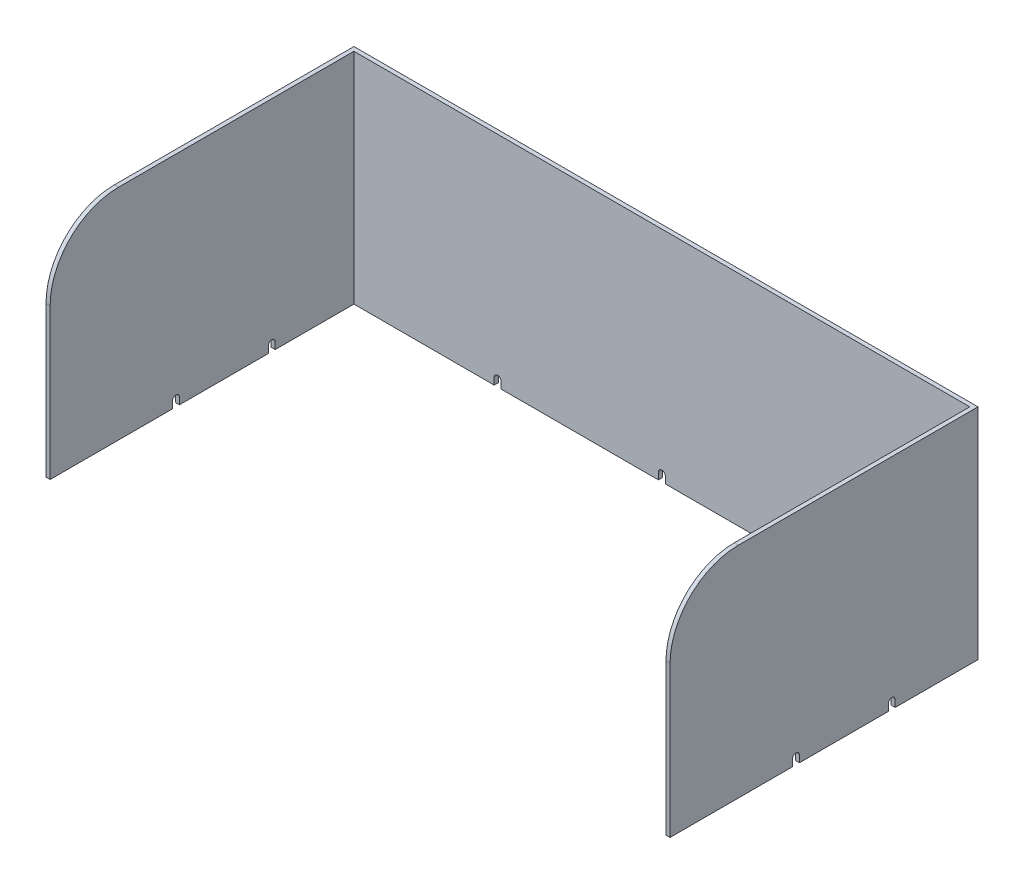
ISO-10303-21;
HEADER;
FILE_DESCRIPTION(('STEP AP214'),'2;1');
FILE_NAME('part.step','',(''),(''),'','','');
FILE_SCHEMA(('AUTOMOTIVE_DESIGN { 1 0 10303 214 1 1 1 1 }'));
ENDSEC;
DATA;
#1=APPLICATION_CONTEXT('core data for automotive mechanical design processes');
#2=APPLICATION_PROTOCOL_DEFINITION('international standard','automotive_design',2000,#1);
#3=PRODUCT_CONTEXT('',#1,'mechanical');
#4=PRODUCT('Part','Part','',(#3));
#5=PRODUCT_RELATED_PRODUCT_CATEGORY('part','',(#4));
#6=PRODUCT_DEFINITION_FORMATION('','',#4);
#7=PRODUCT_DEFINITION_CONTEXT('part definition',#1,'design');
#8=PRODUCT_DEFINITION('design','',#6,#7);
#9=PRODUCT_DEFINITION_SHAPE('','',#8);
#10=(LENGTH_UNIT() NAMED_UNIT(*) SI_UNIT(.MILLI.,.METRE.));
#11=(NAMED_UNIT(*) PLANE_ANGLE_UNIT() SI_UNIT($,.RADIAN.));
#12=(NAMED_UNIT(*) SI_UNIT($,.STERADIAN.) SOLID_ANGLE_UNIT());
#13=UNCERTAINTY_MEASURE_WITH_UNIT(LENGTH_MEASURE(1.E-05),#10,'distance_accuracy_value','');
#14=(GEOMETRIC_REPRESENTATION_CONTEXT(3) GLOBAL_UNCERTAINTY_ASSIGNED_CONTEXT((#13)) GLOBAL_UNIT_ASSIGNED_CONTEXT((#10,
#11,#12)) REPRESENTATION_CONTEXT('',''));
#15=CARTESIAN_POINT('',(0.,0.,0.));
#16=DIRECTION('',(0.,0.,1.));
#17=DIRECTION('',(1.,0.,0.));
#18=AXIS2_PLACEMENT_3D('',#15,#16,#17);
#19=CARTESIAN_POINT('',(3.00000000000002,160.,3.00000000000006));
#20=DIRECTION('',(0.,0.,-1.));
#21=DIRECTION('',(-1.,0.,0.));
#22=AXIS2_PLACEMENT_3D('',#19,#20,#21);
#23=PLANE('',#22);
#24=DIRECTION('',(0.,1.,0.));
#25=VECTOR('',#24,1.);
#26=CARTESIAN_POINT('',(345.5,0.,3.00000000000006));
#27=LINE('',#26,#25);
#28=CARTESIAN_POINT('',(345.5,0.,3.00000000000006));
#29=VERTEX_POINT('',#28);
#30=CARTESIAN_POINT('',(345.5,5.,3.00000000000006));
#31=VERTEX_POINT('',#30);
#32=EDGE_CURVE('E313',#29,#31,#27,.T.);
#33=ORIENTED_EDGE('',*,*,#32,.T.);
#34=CARTESIAN_POINT('',(348.,5.,3.00000000000006));
#35=DIRECTION('',(0.,0.,-1.));
#36=DIRECTION('',(-1.,0.,0.));
#37=AXIS2_PLACEMENT_3D('',#34,#35,#36);
#38=CIRCLE('',#37,2.50000000000002);
#39=CARTESIAN_POINT('',(350.5,5.,3.00000000000006));
#40=VERTEX_POINT('',#39);
#41=EDGE_CURVE('E292',#40,#31,#38,.F.);
#42=ORIENTED_EDGE('',*,*,#41,.F.);
#43=DIRECTION('',(0.,1.,0.));
#44=VECTOR('',#43,1.);
#45=CARTESIAN_POINT('',(350.5,0.,3.00000000000006));
#46=LINE('',#45,#44);
#47=CARTESIAN_POINT('',(350.5,0.,3.00000000000006));
#48=VERTEX_POINT('',#47);
#49=EDGE_CURVE('E303',#48,#40,#46,.T.);
#50=ORIENTED_EDGE('',*,*,#49,.F.);
#51=DIRECTION('',(1.,0.,0.));
#52=VECTOR('',#51,1.);
#53=CARTESIAN_POINT('',(3.00000000000002,0.,3.00000000000006));
#54=LINE('',#53,#52);
#55=CARTESIAN_POINT('',(453.,0.,3.00000000000006));
#56=VERTEX_POINT('',#55);
#57=EDGE_CURVE('E556',#48,#56,#54,.T.);
#58=ORIENTED_EDGE('',*,*,#57,.T.);
#59=DIRECTION('',(0.,-1.,0.));
#60=VECTOR('',#59,1.);
#61=CARTESIAN_POINT('',(453.,160.,3.00000000000006));
#62=LINE('',#61,#60);
#63=CARTESIAN_POINT('',(453.,160.,3.00000000000006));
#64=VERTEX_POINT('',#63);
#65=EDGE_CURVE('E606',#64,#56,#62,.T.);
#66=ORIENTED_EDGE('',*,*,#65,.F.);
#67=DIRECTION('',(1.,0.,0.));
#68=VECTOR('',#67,1.);
#69=CARTESIAN_POINT('',(3.00000000000002,160.,3.00000000000006));
#70=LINE('',#69,#68);
#71=CARTESIAN_POINT('',(3.00000000000002,160.,3.00000000000006));
#72=VERTEX_POINT('',#71);
#73=EDGE_CURVE('E529',#72,#64,#70,.T.);
#74=ORIENTED_EDGE('',*,*,#73,.F.);
#75=DIRECTION('',(0.,-1.,0.));
#76=VECTOR('',#75,1.);
#77=CARTESIAN_POINT('',(3.00000000000002,160.,3.00000000000006));
#78=LINE('',#77,#76);
#79=CARTESIAN_POINT('',(3.00000000000002,0.,3.00000000000006));
#80=VERTEX_POINT('',#79);
#81=EDGE_CURVE('E610',#72,#80,#78,.T.);
#82=ORIENTED_EDGE('',*,*,#81,.T.);
#83=CARTESIAN_POINT('',(105.5,0.,3.00000000000006));
#84=VERTEX_POINT('',#83);
#85=EDGE_CURVE('E558',#80,#84,#54,.T.);
#86=ORIENTED_EDGE('',*,*,#85,.T.);
#87=DIRECTION('',(0.,1.,0.));
#88=VECTOR('',#87,1.);
#89=CARTESIAN_POINT('',(105.5,0.,3.00000000000006));
#90=LINE('',#89,#88);
#91=CARTESIAN_POINT('',(105.5,5.,3.00000000000006));
#92=VERTEX_POINT('',#91);
#93=EDGE_CURVE('E375',#84,#92,#90,.T.);
#94=ORIENTED_EDGE('',*,*,#93,.T.);
#95=CARTESIAN_POINT('',(108.,5.,3.00000000000006));
#96=DIRECTION('',(0.,0.,-1.));
#97=DIRECTION('',(-1.,0.,0.));
#98=AXIS2_PLACEMENT_3D('',#95,#96,#97);
#99=CIRCLE('',#98,2.49999999999999);
#100=CARTESIAN_POINT('',(110.5,5.,3.00000000000006));
#101=VERTEX_POINT('',#100);
#102=EDGE_CURVE('E344',#101,#92,#99,.F.);
#103=ORIENTED_EDGE('',*,*,#102,.F.);
#104=DIRECTION('',(0.,1.,0.));
#105=VECTOR('',#104,1.);
#106=CARTESIAN_POINT('',(110.5,0.,3.00000000000006));
#107=LINE('',#106,#105);
#108=CARTESIAN_POINT('',(110.5,0.,3.00000000000006));
#109=VERTEX_POINT('',#108);
#110=EDGE_CURVE('E371',#109,#101,#107,.T.);
#111=ORIENTED_EDGE('',*,*,#110,.F.);
#112=CARTESIAN_POINT('',(225.5,0.,3.00000000000006));
#113=VERTEX_POINT('',#112);
#114=EDGE_CURVE('E563',#109,#113,#54,.T.);
#115=ORIENTED_EDGE('',*,*,#114,.T.);
#116=DIRECTION('',(0.,1.,0.));
#117=VECTOR('',#116,1.);
#118=CARTESIAN_POINT('',(225.5,0.,3.00000000000006));
#119=LINE('',#118,#117);
#120=CARTESIAN_POINT('',(225.5,5.,3.00000000000006));
#121=VERTEX_POINT('',#120);
#122=EDGE_CURVE('E343',#113,#121,#119,.T.);
#123=ORIENTED_EDGE('',*,*,#122,.T.);
#124=CARTESIAN_POINT('',(228.,5.,3.00000000000006));
#125=DIRECTION('',(0.,0.,-1.));
#126=DIRECTION('',(-1.,0.,0.));
#127=AXIS2_PLACEMENT_3D('',#124,#125,#126);
#128=CIRCLE('',#127,2.5);
#129=CARTESIAN_POINT('',(230.5,5.,3.00000000000006));
#130=VERTEX_POINT('',#129);
#131=EDGE_CURVE('E339',#130,#121,#128,.F.);
#132=ORIENTED_EDGE('',*,*,#131,.F.);
#133=DIRECTION('',(0.,1.,0.));
#134=VECTOR('',#133,1.);
#135=CARTESIAN_POINT('',(230.5,0.,3.00000000000006));
#136=LINE('',#135,#134);
#137=CARTESIAN_POINT('',(230.5,0.,3.00000000000006));
#138=VERTEX_POINT('',#137);
#139=EDGE_CURVE('E315',#138,#130,#136,.T.);
#140=ORIENTED_EDGE('',*,*,#139,.F.);
#141=EDGE_CURVE('E670',#138,#29,#54,.T.);
#142=ORIENTED_EDGE('',*,*,#141,.T.);
#143=EDGE_LOOP('',(#33,#42,#50,#58,#66,#74,#82,#86,#94,#103,#111,#115,#123,#132,#140,#142));
#144=FACE_BOUND('',#143,.T.);
#145=ADVANCED_FACE('F44',(#144),#23,.F.);
#146=CARTESIAN_POINT('',(456.,160.,0.));
#147=DIRECTION('',(0.,0.,1.));
#148=DIRECTION('',(1.,0.,0.));
#149=AXIS2_PLACEMENT_3D('',#146,#147,#148);
#150=PLANE('',#149);
#151=DIRECTION('',(0.,-1.,0.));
#152=VECTOR('',#151,1.);
#153=CARTESIAN_POINT('',(345.5,0.,0.));
#154=LINE('',#153,#152);
#155=CARTESIAN_POINT('',(345.5,5.,0.));
#156=VERTEX_POINT('',#155);
#157=CARTESIAN_POINT('',(345.5,0.,0.));
#158=VERTEX_POINT('',#157);
#159=EDGE_CURVE('E300',#156,#158,#154,.T.);
#160=ORIENTED_EDGE('',*,*,#159,.T.);
#161=DIRECTION('',(-1.,0.,0.));
#162=VECTOR('',#161,1.);
#163=CARTESIAN_POINT('',(456.,0.,0.));
#164=LINE('',#163,#162);
#165=CARTESIAN_POINT('',(230.5,0.,0.));
#166=VERTEX_POINT('',#165);
#167=EDGE_CURVE('E585',#158,#166,#164,.T.);
#168=ORIENTED_EDGE('',*,*,#167,.T.);
#169=DIRECTION('',(0.,-1.,0.));
#170=VECTOR('',#169,1.);
#171=CARTESIAN_POINT('',(230.5,0.,0.));
#172=LINE('',#171,#170);
#173=CARTESIAN_POINT('',(230.5,5.,0.));
#174=VERTEX_POINT('',#173);
#175=EDGE_CURVE('E352',#174,#166,#172,.T.);
#176=ORIENTED_EDGE('',*,*,#175,.F.);
#177=CARTESIAN_POINT('',(228.,5.,0.));
#178=DIRECTION('',(0.,0.,-1.));
#179=DIRECTION('',(-1.,0.,0.));
#180=AXIS2_PLACEMENT_3D('',#177,#178,#179);
#181=CIRCLE('',#180,2.5);
#182=CARTESIAN_POINT('',(225.5,5.,0.));
#183=VERTEX_POINT('',#182);
#184=EDGE_CURVE('E348',#183,#174,#181,.T.);
#185=ORIENTED_EDGE('',*,*,#184,.F.);
#186=DIRECTION('',(0.,-1.,0.));
#187=VECTOR('',#186,1.);
#188=CARTESIAN_POINT('',(225.5,0.,0.));
#189=LINE('',#188,#187);
#190=CARTESIAN_POINT('',(225.5,0.,0.));
#191=VERTEX_POINT('',#190);
#192=EDGE_CURVE('E355',#183,#191,#189,.T.);
#193=ORIENTED_EDGE('',*,*,#192,.T.);
#194=CARTESIAN_POINT('',(110.5,0.,0.));
#195=VERTEX_POINT('',#194);
#196=EDGE_CURVE('E657',#191,#195,#164,.T.);
#197=ORIENTED_EDGE('',*,*,#196,.T.);
#198=DIRECTION('',(0.,-1.,0.));
#199=VECTOR('',#198,1.);
#200=CARTESIAN_POINT('',(110.5,0.,0.));
#201=LINE('',#200,#199);
#202=CARTESIAN_POINT('',(110.5,5.,0.));
#203=VERTEX_POINT('',#202);
#204=EDGE_CURVE('E387',#203,#195,#201,.T.);
#205=ORIENTED_EDGE('',*,*,#204,.F.);
#206=CARTESIAN_POINT('',(108.,5.,0.));
#207=DIRECTION('',(0.,0.,-1.));
#208=DIRECTION('',(-1.,0.,0.));
#209=AXIS2_PLACEMENT_3D('',#206,#207,#208);
#210=CIRCLE('',#209,2.49999999999999);
#211=CARTESIAN_POINT('',(105.5,5.,0.));
#212=VERTEX_POINT('',#211);
#213=EDGE_CURVE('E383',#212,#203,#210,.T.);
#214=ORIENTED_EDGE('',*,*,#213,.F.);
#215=DIRECTION('',(0.,-1.,0.));
#216=VECTOR('',#215,1.);
#217=CARTESIAN_POINT('',(105.5,0.,0.));
#218=LINE('',#217,#216);
#219=CARTESIAN_POINT('',(105.5,0.,0.));
#220=VERTEX_POINT('',#219);
#221=EDGE_CURVE('E379',#212,#220,#218,.T.);
#222=ORIENTED_EDGE('',*,*,#221,.T.);
#223=CARTESIAN_POINT('',(0.,0.,0.));
#224=VERTEX_POINT('',#223);
#225=EDGE_CURVE('E578',#220,#224,#164,.T.);
#226=ORIENTED_EDGE('',*,*,#225,.T.);
#227=DIRECTION('',(0.,-1.,0.));
#228=VECTOR('',#227,1.);
#229=CARTESIAN_POINT('',(0.,160.,0.));
#230=LINE('',#229,#228);
#231=CARTESIAN_POINT('',(0.,160.,0.));
#232=VERTEX_POINT('',#231);
#233=EDGE_CURVE('E592',#232,#224,#230,.T.);
#234=ORIENTED_EDGE('',*,*,#233,.F.);
#235=DIRECTION('',(-1.,0.,0.));
#236=VECTOR('',#235,1.);
#237=CARTESIAN_POINT('',(456.,160.,0.));
#238=LINE('',#237,#236);
#239=CARTESIAN_POINT('',(456.,160.,0.));
#240=VERTEX_POINT('',#239);
#241=EDGE_CURVE('E540',#240,#232,#238,.T.);
#242=ORIENTED_EDGE('',*,*,#241,.F.);
#243=DIRECTION('',(0.,-1.,0.));
#244=VECTOR('',#243,1.);
#245=CARTESIAN_POINT('',(456.,160.,0.));
#246=LINE('',#245,#244);
#247=CARTESIAN_POINT('',(456.,0.,0.));
#248=VERTEX_POINT('',#247);
#249=EDGE_CURVE('E596',#240,#248,#246,.T.);
#250=ORIENTED_EDGE('',*,*,#249,.T.);
#251=CARTESIAN_POINT('',(350.5,0.,0.));
#252=VERTEX_POINT('',#251);
#253=EDGE_CURVE('E580',#248,#252,#164,.T.);
#254=ORIENTED_EDGE('',*,*,#253,.T.);
#255=DIRECTION('',(0.,-1.,0.));
#256=VECTOR('',#255,1.);
#257=CARTESIAN_POINT('',(350.5,0.,0.));
#258=LINE('',#257,#256);
#259=CARTESIAN_POINT('',(350.5,5.,0.));
#260=VERTEX_POINT('',#259);
#261=EDGE_CURVE('E326',#260,#252,#258,.T.);
#262=ORIENTED_EDGE('',*,*,#261,.F.);
#263=CARTESIAN_POINT('',(348.,5.,0.));
#264=DIRECTION('',(0.,0.,-1.));
#265=DIRECTION('',(-1.,0.,0.));
#266=AXIS2_PLACEMENT_3D('',#263,#264,#265);
#267=CIRCLE('',#266,2.50000000000002);
#268=EDGE_CURVE('E295',#156,#260,#267,.T.);
#269=ORIENTED_EDGE('',*,*,#268,.F.);
#270=EDGE_LOOP('',(#160,#168,#176,#185,#193,#197,#205,#214,#222,#226,#234,#242,#250,#254,#262,#269));
#271=FACE_BOUND('',#270,.T.);
#272=ADVANCED_FACE('F773',(#271),#150,.F.);
#273=CARTESIAN_POINT('',(0.,0.,0.));
#274=DIRECTION('',(0.,1.,0.));
#275=DIRECTION('',(0.,0.,1.));
#276=AXIS2_PLACEMENT_3D('',#273,#274,#275);
#277=PLANE('',#276);
#278=DIRECTION('',(0.,0.,-1.));
#279=VECTOR('',#278,1.);
#280=CARTESIAN_POINT('',(345.5,0.,225.001));
#281=LINE('',#280,#279);
#282=EDGE_CURVE('E334',#29,#158,#281,.T.);
#283=ORIENTED_EDGE('',*,*,#282,.F.);
#284=ORIENTED_EDGE('',*,*,#141,.F.);
#285=DIRECTION('',(0.,0.,-1.));
#286=VECTOR('',#285,1.);
#287=CARTESIAN_POINT('',(230.5,0.,225.001));
#288=LINE('',#287,#286);
#289=EDGE_CURVE('E365',#138,#166,#288,.T.);
#290=ORIENTED_EDGE('',*,*,#289,.T.);
#291=ORIENTED_EDGE('',*,*,#167,.F.);
#292=EDGE_LOOP('',(#283,#284,#290,#291));
#293=FACE_BOUND('',#292,.T.);
#294=ADVANCED_FACE('F807',(#293),#277,.F.);
#295=DIRECTION('',(0.,0.,-1.));
#296=VECTOR('',#295,1.);
#297=CARTESIAN_POINT('',(225.5,0.,225.001));
#298=LINE('',#297,#296);
#299=EDGE_CURVE('E362',#113,#191,#298,.T.);
#300=ORIENTED_EDGE('',*,*,#299,.F.);
#301=ORIENTED_EDGE('',*,*,#114,.F.);
#302=DIRECTION('',(0.,0.,-1.));
#303=VECTOR('',#302,1.);
#304=CARTESIAN_POINT('',(110.5,0.,225.001));
#305=LINE('',#304,#303);
#306=EDGE_CURVE('E394',#109,#195,#305,.T.);
#307=ORIENTED_EDGE('',*,*,#306,.T.);
#308=ORIENTED_EDGE('',*,*,#196,.F.);
#309=EDGE_LOOP('',(#300,#301,#307,#308));
#310=FACE_BOUND('',#309,.T.);
#311=ADVANCED_FACE('F866',(#310),#277,.F.);
#312=DIRECTION('',(0.,0.,-1.));
#313=VECTOR('',#312,1.);
#314=CARTESIAN_POINT('',(105.5,0.,225.001));
#315=LINE('',#314,#313);
#316=EDGE_CURVE('E391',#84,#220,#315,.T.);
#317=ORIENTED_EDGE('',*,*,#316,.F.);
#318=ORIENTED_EDGE('',*,*,#85,.F.);
#319=DIRECTION('',(0.,0.,-1.));
#320=VECTOR('',#319,1.);
#321=CARTESIAN_POINT('',(3.00000000000008,0.,225.));
#322=LINE('',#321,#320);
#323=CARTESIAN_POINT('',(3.00000000000006,0.,60.5));
#324=VERTEX_POINT('',#323);
#325=EDGE_CURVE('E551',#324,#80,#322,.T.);
#326=ORIENTED_EDGE('',*,*,#325,.F.);
#327=DIRECTION('',(-1.,0.,0.));
#328=VECTOR('',#327,1.);
#329=CARTESIAN_POINT('',(0.,0.,60.5));
#330=LINE('',#329,#328);
#331=CARTESIAN_POINT('',(0.,0.,60.5));
#332=VERTEX_POINT('',#331);
#333=EDGE_CURVE('E624',#324,#332,#330,.T.);
#334=ORIENTED_EDGE('',*,*,#333,.T.);
#335=DIRECTION('',(0.,0.,1.));
#336=VECTOR('',#335,1.);
#337=CARTESIAN_POINT('',(0.,0.,0.));
#338=LINE('',#337,#336);
#339=EDGE_CURVE('E530',#224,#332,#338,.T.);
#340=ORIENTED_EDGE('',*,*,#339,.F.);
#341=ORIENTED_EDGE('',*,*,#225,.F.);
#342=EDGE_LOOP('',(#317,#318,#326,#334,#340,#341));
#343=FACE_BOUND('',#342,.T.);
#344=ADVANCED_FACE('F780',(#343),#277,.F.);
#345=CARTESIAN_POINT('',(3.00000000000008,160.,225.));
#346=DIRECTION('',(-1.,0.,0.));
#347=DIRECTION('',(0.,0.,1.));
#348=AXIS2_PLACEMENT_3D('',#345,#346,#347);
#349=PLANE('',#348);
#350=DIRECTION('',(0.,0.,-1.));
#351=VECTOR('',#350,1.);
#352=CARTESIAN_POINT('',(3.00000000000008,160.,225.));
#353=LINE('',#352,#351);
#354=CARTESIAN_POINT('',(3.00000000000007,160.,175.));
#355=VERTEX_POINT('',#354);
#356=EDGE_CURVE('E526',#355,#72,#353,.T.);
#357=ORIENTED_EDGE('',*,*,#356,.F.);
#358=CARTESIAN_POINT('',(3.00000000000007,110.,175.));
#359=DIRECTION('',(-1.,0.,0.));
#360=DIRECTION('',(0.,0.,1.));
#361=AXIS2_PLACEMENT_3D('',#358,#359,#360);
#362=CIRCLE('',#361,50.);
#363=CARTESIAN_POINT('',(3.00000000000008,110.,225.));
#364=VERTEX_POINT('',#363);
#365=EDGE_CURVE('E67',#355,#364,#362,.F.);
#366=ORIENTED_EDGE('',*,*,#365,.T.);
#367=DIRECTION('',(0.,-1.,0.));
#368=VECTOR('',#367,1.);
#369=CARTESIAN_POINT('',(3.00000000000008,160.,225.));
#370=LINE('',#369,#368);
#371=CARTESIAN_POINT('',(3.00000000000008,0.,225.));
#372=VERTEX_POINT('',#371);
#373=EDGE_CURVE('E614',#364,#372,#370,.T.);
#374=ORIENTED_EDGE('',*,*,#373,.T.);
#375=CARTESIAN_POINT('',(3.00000000000006,0.,135.5));
#376=VERTEX_POINT('',#375);
#377=EDGE_CURVE('E552',#372,#376,#322,.T.);
#378=ORIENTED_EDGE('',*,*,#377,.T.);
#379=DIRECTION('',(0.,-1.,0.));
#380=VECTOR('',#379,1.);
#381=CARTESIAN_POINT('',(3.00000000000006,160.,135.5));
#382=LINE('',#381,#380);
#383=CARTESIAN_POINT('',(3.00000000000006,5.00000000000001,135.5));
#384=VERTEX_POINT('',#383);
#385=EDGE_CURVE('E492',#384,#376,#382,.T.);
#386=ORIENTED_EDGE('',*,*,#385,.F.);
#387=CARTESIAN_POINT('',(3.00000000000006,5.,133.));
#388=DIRECTION('',(-1.,0.,0.));
#389=DIRECTION('',(0.,0.,1.));
#390=AXIS2_PLACEMENT_3D('',#387,#388,#389);
#391=CIRCLE('',#390,2.5);
#392=CARTESIAN_POINT('',(3.00000000000006,5.00000000000001,130.5));
#393=VERTEX_POINT('',#392);
#394=EDGE_CURVE('E513',#384,#393,#391,.T.);
#395=ORIENTED_EDGE('',*,*,#394,.T.);
#396=DIRECTION('',(0.,-1.,0.));
#397=VECTOR('',#396,1.);
#398=CARTESIAN_POINT('',(3.00000000000006,160.,130.5));
#399=LINE('',#398,#397);
#400=CARTESIAN_POINT('',(3.00000000000006,0.,130.5));
#401=VERTEX_POINT('',#400);
#402=EDGE_CURVE('E485',#393,#401,#399,.T.);
#403=ORIENTED_EDGE('',*,*,#402,.T.);
#404=CARTESIAN_POINT('',(3.00000000000006,0.,65.5));
#405=VERTEX_POINT('',#404);
#406=EDGE_CURVE('E557',#401,#405,#322,.T.);
#407=ORIENTED_EDGE('',*,*,#406,.T.);
#408=DIRECTION('',(0.,-1.,0.));
#409=VECTOR('',#408,1.);
#410=CARTESIAN_POINT('',(3.00000000000004,160.,65.5));
#411=LINE('',#410,#409);
#412=CARTESIAN_POINT('',(3.,5.,65.5));
#413=VERTEX_POINT('',#412);
#414=EDGE_CURVE('E506',#413,#405,#411,.T.);
#415=ORIENTED_EDGE('',*,*,#414,.F.);
#416=CARTESIAN_POINT('',(3.,5.,63.));
#417=DIRECTION('',(-1.,0.,0.));
#418=DIRECTION('',(0.,0.,1.));
#419=AXIS2_PLACEMENT_3D('',#416,#417,#418);
#420=CIRCLE('',#419,2.5);
#421=CARTESIAN_POINT('',(3.,5.,60.5));
#422=VERTEX_POINT('',#421);
#423=EDGE_CURVE('E521',#413,#422,#420,.T.);
#424=ORIENTED_EDGE('',*,*,#423,.T.);
#425=DIRECTION('',(0.,-1.,0.));
#426=VECTOR('',#425,1.);
#427=CARTESIAN_POINT('',(3.00000000000004,160.,60.5));
#428=LINE('',#427,#426);
#429=EDGE_CURVE('E499',#422,#324,#428,.T.);
#430=ORIENTED_EDGE('',*,*,#429,.T.);
#431=ORIENTED_EDGE('',*,*,#325,.T.);
#432=ORIENTED_EDGE('',*,*,#81,.F.);
#433=EDGE_LOOP('',(#357,#366,#374,#378,#386,#395,#403,#407,#415,#424,#430,#431,#432));
#434=FACE_BOUND('',#433,.T.);
#435=ADVANCED_FACE('F701',(#434),#349,.F.);
#436=CARTESIAN_POINT('',(453.,160.,3.00000000000006));
#437=DIRECTION('',(1.,0.,0.));
#438=DIRECTION('',(0.,0.,-1.));
#439=AXIS2_PLACEMENT_3D('',#436,#437,#438);
#440=PLANE('',#439);
#441=DIRECTION('',(0.,-1.,0.));
#442=VECTOR('',#441,1.);
#443=CARTESIAN_POINT('',(453.,160.,225.));
#444=LINE('',#443,#442);
#445=CARTESIAN_POINT('',(453.,110.,225.));
#446=VERTEX_POINT('',#445);
#447=CARTESIAN_POINT('',(453.,0.,225.));
#448=VERTEX_POINT('',#447);
#449=EDGE_CURVE('E603',#446,#448,#444,.T.);
#450=ORIENTED_EDGE('',*,*,#449,.F.);
#451=CARTESIAN_POINT('',(453.,110.,175.));
#452=DIRECTION('',(1.,0.,0.));
#453=DIRECTION('',(0.,0.,-1.));
#454=AXIS2_PLACEMENT_3D('',#451,#452,#453);
#455=CIRCLE('',#454,50.);
#456=CARTESIAN_POINT('',(453.,160.,175.));
#457=VERTEX_POINT('',#456);
#458=EDGE_CURVE('E645',#446,#457,#455,.F.);
#459=ORIENTED_EDGE('',*,*,#458,.T.);
#460=DIRECTION('',(0.,0.,1.));
#461=VECTOR('',#460,1.);
#462=CARTESIAN_POINT('',(453.,160.,3.00000000000006));
#463=LINE('',#462,#461);
#464=EDGE_CURVE('E533',#64,#457,#463,.T.);
#465=ORIENTED_EDGE('',*,*,#464,.F.);
#466=ORIENTED_EDGE('',*,*,#65,.T.);
#467=DIRECTION('',(0.,0.,1.));
#468=VECTOR('',#467,1.);
#469=CARTESIAN_POINT('',(453.,0.,3.00000000000006));
#470=LINE('',#469,#468);
#471=CARTESIAN_POINT('',(453.,0.,60.5));
#472=VERTEX_POINT('',#471);
#473=EDGE_CURVE('E564',#56,#472,#470,.T.);
#474=ORIENTED_EDGE('',*,*,#473,.T.);
#475=DIRECTION('',(0.,1.,0.));
#476=VECTOR('',#475,1.);
#477=CARTESIAN_POINT('',(453.,160.,60.4999999999999));
#478=LINE('',#477,#476);
#479=CARTESIAN_POINT('',(453.,5.,60.4999999999999));
#480=VERTEX_POINT('',#479);
#481=EDGE_CURVE('E495',#472,#480,#478,.T.);
#482=ORIENTED_EDGE('',*,*,#481,.T.);
#483=CARTESIAN_POINT('',(453.,5.,62.9999999999999));
#484=DIRECTION('',(1.,0.,0.));
#485=DIRECTION('',(0.,0.,-1.));
#486=AXIS2_PLACEMENT_3D('',#483,#484,#485);
#487=CIRCLE('',#486,2.5);
#488=CARTESIAN_POINT('',(453.,5.,65.4999999999999));
#489=VERTEX_POINT('',#488);
#490=EDGE_CURVE('E517',#480,#489,#487,.T.);
#491=ORIENTED_EDGE('',*,*,#490,.T.);
#492=DIRECTION('',(0.,1.,0.));
#493=VECTOR('',#492,1.);
#494=CARTESIAN_POINT('',(453.,160.,65.4999999999999));
#495=LINE('',#494,#493);
#496=CARTESIAN_POINT('',(453.,0.,65.4999999999999));
#497=VERTEX_POINT('',#496);
#498=EDGE_CURVE('E503',#497,#489,#495,.T.);
#499=ORIENTED_EDGE('',*,*,#498,.F.);
#500=CARTESIAN_POINT('',(453.,0.,130.5));
#501=VERTEX_POINT('',#500);
#502=EDGE_CURVE('E569',#497,#501,#470,.T.);
#503=ORIENTED_EDGE('',*,*,#502,.T.);
#504=DIRECTION('',(0.,1.,0.));
#505=VECTOR('',#504,1.);
#506=CARTESIAN_POINT('',(453.,160.,130.5));
#507=LINE('',#506,#505);
#508=CARTESIAN_POINT('',(453.,5.00000000000001,130.5));
#509=VERTEX_POINT('',#508);
#510=EDGE_CURVE('E445',#501,#509,#507,.T.);
#511=ORIENTED_EDGE('',*,*,#510,.T.);
#512=CARTESIAN_POINT('',(453.,5.,133.));
#513=DIRECTION('',(1.,0.,0.));
#514=DIRECTION('',(0.,0.,-1.));
#515=AXIS2_PLACEMENT_3D('',#512,#513,#514);
#516=CIRCLE('',#515,2.5);
#517=CARTESIAN_POINT('',(453.,5.00000000000001,135.5));
#518=VERTEX_POINT('',#517);
#519=EDGE_CURVE('E509',#509,#518,#516,.T.);
#520=ORIENTED_EDGE('',*,*,#519,.T.);
#521=DIRECTION('',(0.,1.,0.));
#522=VECTOR('',#521,1.);
#523=CARTESIAN_POINT('',(453.,160.,135.5));
#524=LINE('',#523,#522);
#525=CARTESIAN_POINT('',(453.,0.,135.5));
#526=VERTEX_POINT('',#525);
#527=EDGE_CURVE('E489',#526,#518,#524,.T.);
#528=ORIENTED_EDGE('',*,*,#527,.F.);
#529=EDGE_CURVE('E562',#526,#448,#470,.T.);
#530=ORIENTED_EDGE('',*,*,#529,.T.);
#531=EDGE_LOOP('',(#450,#459,#465,#466,#474,#482,#491,#499,#503,#511,#520,#528,#530));
#532=FACE_BOUND('',#531,.T.);
#533=ADVANCED_FACE('F747',(#532),#440,.F.);
#534=CARTESIAN_POINT('',(456.,160.,225.));
#535=DIRECTION('',(-1.,0.,0.));
#536=DIRECTION('',(0.,0.,1.));
#537=AXIS2_PLACEMENT_3D('',#534,#535,#536);
#538=PLANE('',#537);
#539=DIRECTION('',(0.,0.,-1.));
#540=VECTOR('',#539,1.);
#541=CARTESIAN_POINT('',(456.,160.,225.));
#542=LINE('',#541,#540);
#543=CARTESIAN_POINT('',(456.,160.,175.));
#544=VERTEX_POINT('',#543);
#545=EDGE_CURVE('E537',#544,#240,#542,.T.);
#546=ORIENTED_EDGE('',*,*,#545,.F.);
#547=CARTESIAN_POINT('',(456.,110.,175.));
#548=DIRECTION('',(-1.,0.,0.));
#549=DIRECTION('',(0.,0.,1.));
#550=AXIS2_PLACEMENT_3D('',#547,#548,#549);
#551=CIRCLE('',#550,50.);
#552=CARTESIAN_POINT('',(456.,110.,225.));
#553=VERTEX_POINT('',#552);
#554=EDGE_CURVE('E639',#544,#553,#551,.F.);
#555=ORIENTED_EDGE('',*,*,#554,.T.);
#556=DIRECTION('',(0.,-1.,0.));
#557=VECTOR('',#556,1.);
#558=CARTESIAN_POINT('',(456.,160.,225.));
#559=LINE('',#558,#557);
#560=CARTESIAN_POINT('',(456.,0.,225.));
#561=VERTEX_POINT('',#560);
#562=EDGE_CURVE('E600',#553,#561,#559,.T.);
#563=ORIENTED_EDGE('',*,*,#562,.T.);
#564=DIRECTION('',(0.,0.,-1.));
#565=VECTOR('',#564,1.);
#566=CARTESIAN_POINT('',(456.,0.,225.));
#567=LINE('',#566,#565);
#568=CARTESIAN_POINT('',(456.,0.,135.5));
#569=VERTEX_POINT('',#568);
#570=EDGE_CURVE('E574',#561,#569,#567,.T.);
#571=ORIENTED_EDGE('',*,*,#570,.T.);
#572=DIRECTION('',(0.,1.,0.));
#573=VECTOR('',#572,1.);
#574=CARTESIAN_POINT('',(456.,0.,135.5));
#575=LINE('',#574,#573);
#576=CARTESIAN_POINT('',(456.,5.,135.5));
#577=VERTEX_POINT('',#576);
#578=EDGE_CURVE('E449',#569,#577,#575,.T.);
#579=ORIENTED_EDGE('',*,*,#578,.T.);
#580=CARTESIAN_POINT('',(456.,5.,133.));
#581=DIRECTION('',(-1.,0.,0.));
#582=DIRECTION('',(0.,0.,1.));
#583=AXIS2_PLACEMENT_3D('',#580,#581,#582);
#584=CIRCLE('',#583,2.5);
#585=CARTESIAN_POINT('',(456.,5.00000000000001,130.5));
#586=VERTEX_POINT('',#585);
#587=EDGE_CURVE('E420',#586,#577,#584,.F.);
#588=ORIENTED_EDGE('',*,*,#587,.F.);
#589=DIRECTION('',(0.,1.,0.));
#590=VECTOR('',#589,1.);
#591=CARTESIAN_POINT('',(456.,0.,130.5));
#592=LINE('',#591,#590);
#593=CARTESIAN_POINT('',(456.,0.,130.5));
#594=VERTEX_POINT('',#593);
#595=EDGE_CURVE('E446',#594,#586,#592,.T.);
#596=ORIENTED_EDGE('',*,*,#595,.F.);
#597=CARTESIAN_POINT('',(456.,0.,65.5));
#598=VERTEX_POINT('',#597);
#599=EDGE_CURVE('E579',#594,#598,#567,.T.);
#600=ORIENTED_EDGE('',*,*,#599,.T.);
#601=DIRECTION('',(0.,1.,0.));
#602=VECTOR('',#601,1.);
#603=CARTESIAN_POINT('',(456.,0.,65.4999999999999));
#604=LINE('',#603,#602);
#605=CARTESIAN_POINT('',(456.,5.,65.4999999999999));
#606=VERTEX_POINT('',#605);
#607=EDGE_CURVE('E409',#598,#606,#604,.T.);
#608=ORIENTED_EDGE('',*,*,#607,.T.);
#609=CARTESIAN_POINT('',(456.,5.,62.9999999999999));
#610=DIRECTION('',(-1.,0.,0.));
#611=DIRECTION('',(0.,0.,1.));
#612=AXIS2_PLACEMENT_3D('',#609,#610,#611);
#613=CIRCLE('',#612,2.5);
#614=CARTESIAN_POINT('',(456.,5.,60.4999999999999));
#615=VERTEX_POINT('',#614);
#616=EDGE_CURVE('E414',#615,#606,#613,.F.);
#617=ORIENTED_EDGE('',*,*,#616,.F.);
#618=DIRECTION('',(0.,1.,0.));
#619=VECTOR('',#618,1.);
#620=CARTESIAN_POINT('',(456.,0.,60.4999999999999));
#621=LINE('',#620,#619);
#622=CARTESIAN_POINT('',(456.,0.,60.4999999999999));
#623=VERTEX_POINT('',#622);
#624=EDGE_CURVE('E406',#623,#615,#621,.T.);
#625=ORIENTED_EDGE('',*,*,#624,.F.);
#626=EDGE_CURVE('E573',#623,#248,#567,.T.);
#627=ORIENTED_EDGE('',*,*,#626,.T.);
#628=ORIENTED_EDGE('',*,*,#249,.F.);
#629=EDGE_LOOP('',(#546,#555,#563,#571,#579,#588,#596,#600,#608,#617,#625,#627,#628));
#630=FACE_BOUND('',#629,.T.);
#631=ADVANCED_FACE('F727',(#630),#538,.F.);
#632=CARTESIAN_POINT('',(0.,160.,0.));
#633=DIRECTION('',(1.,0.,0.));
#634=DIRECTION('',(0.,0.,-1.));
#635=AXIS2_PLACEMENT_3D('',#632,#633,#634);
#636=PLANE('',#635);
#637=DIRECTION('',(0.,-1.,0.));
#638=VECTOR('',#637,1.);
#639=CARTESIAN_POINT('',(0.,160.,225.));
#640=LINE('',#639,#638);
#641=CARTESIAN_POINT('',(0.,110.,225.));
#642=VERTEX_POINT('',#641);
#643=CARTESIAN_POINT('',(0.,0.,225.));
#644=VERTEX_POINT('',#643);
#645=EDGE_CURVE('E547',#642,#644,#640,.T.);
#646=ORIENTED_EDGE('',*,*,#645,.F.);
#647=CARTESIAN_POINT('',(0.,110.,175.));
#648=DIRECTION('',(1.,0.,0.));
#649=DIRECTION('',(0.,0.,-1.));
#650=AXIS2_PLACEMENT_3D('',#647,#648,#649);
#651=CIRCLE('',#650,50.);
#652=CARTESIAN_POINT('',(0.,160.,175.));
#653=VERTEX_POINT('',#652);
#654=EDGE_CURVE('E11',#642,#653,#651,.F.);
#655=ORIENTED_EDGE('',*,*,#654,.T.);
#656=DIRECTION('',(0.,0.,1.));
#657=VECTOR('',#656,1.);
#658=CARTESIAN_POINT('',(0.,160.,0.));
#659=LINE('',#658,#657);
#660=EDGE_CURVE('E543',#232,#653,#659,.T.);
#661=ORIENTED_EDGE('',*,*,#660,.F.);
#662=ORIENTED_EDGE('',*,*,#233,.T.);
#663=ORIENTED_EDGE('',*,*,#339,.T.);
#664=DIRECTION('',(0.,-1.,0.));
#665=VECTOR('',#664,1.);
#666=CARTESIAN_POINT('',(0.,0.,60.5));
#667=LINE('',#666,#665);
#668=CARTESIAN_POINT('',(0.,5.,60.5));
#669=VERTEX_POINT('',#668);
#670=EDGE_CURVE('E424',#669,#332,#667,.T.);
#671=ORIENTED_EDGE('',*,*,#670,.F.);
#672=CARTESIAN_POINT('',(0.,5.,63.));
#673=DIRECTION('',(-1.,0.,0.));
#674=DIRECTION('',(0.,0.,1.));
#675=AXIS2_PLACEMENT_3D('',#672,#673,#674);
#676=CIRCLE('',#675,2.5);
#677=CARTESIAN_POINT('',(0.,5.,65.5));
#678=VERTEX_POINT('',#677);
#679=EDGE_CURVE('E419',#678,#669,#676,.T.);
#680=ORIENTED_EDGE('',*,*,#679,.F.);
#681=DIRECTION('',(0.,-1.,0.));
#682=VECTOR('',#681,1.);
#683=CARTESIAN_POINT('',(0.,0.,65.5));
#684=LINE('',#683,#682);
#685=CARTESIAN_POINT('',(0.,0.,65.5));
#686=VERTEX_POINT('',#685);
#687=EDGE_CURVE('E415',#678,#686,#684,.T.);
#688=ORIENTED_EDGE('',*,*,#687,.T.);
#689=CARTESIAN_POINT('',(0.,0.,130.5));
#690=VERTEX_POINT('',#689);
#691=EDGE_CURVE('E589',#686,#690,#338,.T.);
#692=ORIENTED_EDGE('',*,*,#691,.T.);
#693=DIRECTION('',(0.,-1.,0.));
#694=VECTOR('',#693,1.);
#695=CARTESIAN_POINT('',(0.,0.,130.5));
#696=LINE('',#695,#694);
#697=CARTESIAN_POINT('',(0.,5.00000000000001,130.5));
#698=VERTEX_POINT('',#697);
#699=EDGE_CURVE('E461',#698,#690,#696,.T.);
#700=ORIENTED_EDGE('',*,*,#699,.F.);
#701=CARTESIAN_POINT('',(0.,5.,133.));
#702=DIRECTION('',(-1.,0.,0.));
#703=DIRECTION('',(0.,0.,1.));
#704=AXIS2_PLACEMENT_3D('',#701,#702,#703);
#705=CIRCLE('',#704,2.5);
#706=CARTESIAN_POINT('',(0.,5.00000000000001,135.5));
#707=VERTEX_POINT('',#706);
#708=EDGE_CURVE('E457',#707,#698,#705,.T.);
#709=ORIENTED_EDGE('',*,*,#708,.F.);
#710=DIRECTION('',(0.,-1.,0.));
#711=VECTOR('',#710,1.);
#712=CARTESIAN_POINT('',(0.,0.,135.5));
#713=LINE('',#712,#711);
#714=CARTESIAN_POINT('',(0.,0.,135.5));
#715=VERTEX_POINT('',#714);
#716=EDGE_CURVE('E309',#707,#715,#713,.T.);
#717=ORIENTED_EDGE('',*,*,#716,.T.);
#718=EDGE_CURVE('E584',#715,#644,#338,.T.);
#719=ORIENTED_EDGE('',*,*,#718,.T.);
#720=EDGE_LOOP('',(#646,#655,#661,#662,#663,#671,#680,#688,#692,#700,#709,#717,#719));
#721=FACE_BOUND('',#720,.T.);
#722=ADVANCED_FACE('F692',(#721),#636,.F.);
#723=DIRECTION('',(-1.,0.,0.));
#724=VECTOR('',#723,1.);
#725=CARTESIAN_POINT('',(465.01387818866,0.,65.4999999999999));
#726=LINE('',#725,#724);
#727=EDGE_CURVE('E410',#598,#497,#726,.T.);
#728=ORIENTED_EDGE('',*,*,#727,.F.);
#729=ORIENTED_EDGE('',*,*,#599,.F.);
#730=DIRECTION('',(-1.,0.,0.));
#731=VECTOR('',#730,1.);
#732=CARTESIAN_POINT('',(465.01387818866,0.,130.5));
#733=LINE('',#732,#731);
#734=EDGE_CURVE('E467',#594,#501,#733,.T.);
#735=ORIENTED_EDGE('',*,*,#734,.T.);
#736=ORIENTED_EDGE('',*,*,#502,.F.);
#737=EDGE_LOOP('',(#728,#729,#735,#736));
#738=FACE_BOUND('',#737,.T.);
#739=ADVANCED_FACE('F755',(#738),#277,.F.);
#740=DIRECTION('',(-1.,0.,0.));
#741=VECTOR('',#740,1.);
#742=CARTESIAN_POINT('',(0.,0.,65.5));
#743=LINE('',#742,#741);
#744=EDGE_CURVE('E628',#405,#686,#743,.T.);
#745=ORIENTED_EDGE('',*,*,#744,.F.);
#746=ORIENTED_EDGE('',*,*,#406,.F.);
#747=DIRECTION('',(-1.,0.,0.));
#748=VECTOR('',#747,1.);
#749=CARTESIAN_POINT('',(0.,0.,130.5));
#750=LINE('',#749,#748);
#751=EDGE_CURVE('E617',#401,#690,#750,.T.);
#752=ORIENTED_EDGE('',*,*,#751,.T.);
#753=ORIENTED_EDGE('',*,*,#691,.F.);
#754=EDGE_LOOP('',(#745,#746,#752,#753));
#755=FACE_BOUND('',#754,.T.);
#756=ADVANCED_FACE('F699',(#755),#277,.F.);
#757=DIRECTION('',(-1.,0.,0.));
#758=VECTOR('',#757,1.);
#759=CARTESIAN_POINT('',(465.01387818866,0.,135.5));
#760=LINE('',#759,#758);
#761=EDGE_CURVE('E450',#569,#526,#760,.T.);
#762=ORIENTED_EDGE('',*,*,#761,.F.);
#763=ORIENTED_EDGE('',*,*,#570,.F.);
#764=DIRECTION('',(1.,0.,0.));
#765=VECTOR('',#764,1.);
#766=CARTESIAN_POINT('',(453.,0.,225.));
#767=LINE('',#766,#765);
#768=EDGE_CURVE('E568',#448,#561,#767,.T.);
#769=ORIENTED_EDGE('',*,*,#768,.F.);
#770=ORIENTED_EDGE('',*,*,#529,.F.);
#771=EDGE_LOOP('',(#762,#763,#769,#770));
#772=FACE_BOUND('',#771,.T.);
#773=ADVANCED_FACE('F737',(#772),#277,.F.);
#774=DIRECTION('',(-1.,0.,0.));
#775=VECTOR('',#774,1.);
#776=CARTESIAN_POINT('',(0.,0.,135.5));
#777=LINE('',#776,#775);
#778=EDGE_CURVE('E621',#376,#715,#777,.T.);
#779=ORIENTED_EDGE('',*,*,#778,.F.);
#780=ORIENTED_EDGE('',*,*,#377,.F.);
#781=DIRECTION('',(1.,0.,0.));
#782=VECTOR('',#781,1.);
#783=CARTESIAN_POINT('',(0.,0.,225.));
#784=LINE('',#783,#782);
#785=EDGE_CURVE('E525',#644,#372,#784,.T.);
#786=ORIENTED_EDGE('',*,*,#785,.F.);
#787=ORIENTED_EDGE('',*,*,#718,.F.);
#788=EDGE_LOOP('',(#779,#780,#786,#787));
#789=FACE_BOUND('',#788,.T.);
#790=ADVANCED_FACE('F704',(#789),#277,.F.);
#791=CARTESIAN_POINT('',(0.,160.,225.));
#792=DIRECTION('',(0.,0.,-1.));
#793=DIRECTION('',(-1.,0.,0.));
#794=AXIS2_PLACEMENT_3D('',#791,#792,#793);
#795=PLANE('',#794);
#796=ORIENTED_EDGE('',*,*,#373,.F.);
#797=DIRECTION('',(1.,0.,0.));
#798=VECTOR('',#797,1.);
#799=CARTESIAN_POINT('',(0.,110.,225.));
#800=LINE('',#799,#798);
#801=EDGE_CURVE('E53',#364,#642,#800,.F.);
#802=ORIENTED_EDGE('',*,*,#801,.T.);
#803=ORIENTED_EDGE('',*,*,#645,.T.);
#804=ORIENTED_EDGE('',*,*,#785,.T.);
#805=EDGE_LOOP('',(#796,#802,#803,#804));
#806=FACE_BOUND('',#805,.T.);
#807=ADVANCED_FACE('F814',(#806),#795,.F.);
#808=CARTESIAN_POINT('',(453.,160.,225.));
#809=DIRECTION('',(0.,0.,-1.));
#810=DIRECTION('',(-1.,0.,0.));
#811=AXIS2_PLACEMENT_3D('',#808,#809,#810);
#812=PLANE('',#811);
#813=ORIENTED_EDGE('',*,*,#562,.F.);
#814=DIRECTION('',(1.,0.,0.));
#815=VECTOR('',#814,1.);
#816=CARTESIAN_POINT('',(453.,110.,225.));
#817=LINE('',#816,#815);
#818=EDGE_CURVE('E642',#553,#446,#817,.F.);
#819=ORIENTED_EDGE('',*,*,#818,.T.);
#820=ORIENTED_EDGE('',*,*,#449,.T.);
#821=ORIENTED_EDGE('',*,*,#768,.T.);
#822=EDGE_LOOP('',(#813,#819,#820,#821));
#823=FACE_BOUND('',#822,.T.);
#824=ADVANCED_FACE('F730',(#823),#812,.F.);
#825=CARTESIAN_POINT('',(0.,160.,0.));
#826=DIRECTION('',(0.,1.,0.));
#827=DIRECTION('',(0.,0.,1.));
#828=AXIS2_PLACEMENT_3D('',#825,#826,#827);
#829=PLANE('',#828);
#830=ORIENTED_EDGE('',*,*,#464,.T.);
#831=DIRECTION('',(1.,0.,0.));
#832=VECTOR('',#831,1.);
#833=CARTESIAN_POINT('',(456.,160.,175.));
#834=LINE('',#833,#832);
#835=EDGE_CURVE('E635',#457,#544,#834,.T.);
#836=ORIENTED_EDGE('',*,*,#835,.T.);
#837=ORIENTED_EDGE('',*,*,#545,.T.);
#838=ORIENTED_EDGE('',*,*,#241,.T.);
#839=ORIENTED_EDGE('',*,*,#660,.T.);
#840=DIRECTION('',(1.,0.,0.));
#841=VECTOR('',#840,1.);
#842=CARTESIAN_POINT('',(3.00000000000008,160.,175.));
#843=LINE('',#842,#841);
#844=EDGE_CURVE('E631',#653,#355,#843,.T.);
#845=ORIENTED_EDGE('',*,*,#844,.T.);
#846=ORIENTED_EDGE('',*,*,#356,.T.);
#847=ORIENTED_EDGE('',*,*,#73,.T.);
#848=EDGE_LOOP('',(#830,#836,#837,#838,#839,#845,#846,#847));
#849=FACE_BOUND('',#848,.T.);
#850=ADVANCED_FACE('F711',(#849),#829,.T.);
#851=ORIENTED_EDGE('',*,*,#57,.F.);
#852=DIRECTION('',(0.,0.,-1.));
#853=VECTOR('',#852,1.);
#854=CARTESIAN_POINT('',(350.5,0.,225.001));
#855=LINE('',#854,#853);
#856=EDGE_CURVE('E299',#48,#252,#855,.T.);
#857=ORIENTED_EDGE('',*,*,#856,.T.);
#858=ORIENTED_EDGE('',*,*,#253,.F.);
#859=ORIENTED_EDGE('',*,*,#626,.F.);
#860=DIRECTION('',(-1.,0.,0.));
#861=VECTOR('',#860,1.);
#862=CARTESIAN_POINT('',(465.01387818866,0.,60.4999999999999));
#863=LINE('',#862,#861);
#864=EDGE_CURVE('E430',#623,#472,#863,.T.);
#865=ORIENTED_EDGE('',*,*,#864,.T.);
#866=ORIENTED_EDGE('',*,*,#473,.F.);
#867=EDGE_LOOP('',(#851,#857,#858,#859,#865,#866));
#868=FACE_BOUND('',#867,.T.);
#869=ADVANCED_FACE('F769',(#868),#277,.F.);
#870=CARTESIAN_POINT('',(465.01387818866,0.,130.5));
#871=DIRECTION('',(0.,0.,-1.));
#872=DIRECTION('',(-1.,0.,0.));
#873=AXIS2_PLACEMENT_3D('',#870,#871,#872);
#874=PLANE('',#873);
#875=DIRECTION('',(-1.,0.,0.));
#876=VECTOR('',#875,1.);
#877=CARTESIAN_POINT('',(465.01387818866,5.00000000000001,130.5));
#878=LINE('',#877,#876);
#879=EDGE_CURVE('E475',#393,#698,#878,.T.);
#880=ORIENTED_EDGE('',*,*,#879,.T.);
#881=ORIENTED_EDGE('',*,*,#699,.T.);
#882=ORIENTED_EDGE('',*,*,#751,.F.);
#883=ORIENTED_EDGE('',*,*,#402,.F.);
#884=EDGE_LOOP('',(#880,#881,#882,#883));
#885=FACE_BOUND('',#884,.T.);
#886=ADVANCED_FACE('F695',(#885),#874,.F.);
#887=CARTESIAN_POINT('',(465.01387818866,0.,135.5));
#888=DIRECTION('',(0.,0.,-1.));
#889=DIRECTION('',(-1.,0.,0.));
#890=AXIS2_PLACEMENT_3D('',#887,#888,#889);
#891=PLANE('',#890);
#892=ORIENTED_EDGE('',*,*,#385,.T.);
#893=ORIENTED_EDGE('',*,*,#778,.T.);
#894=ORIENTED_EDGE('',*,*,#716,.F.);
#895=DIRECTION('',(-1.,0.,0.));
#896=VECTOR('',#895,1.);
#897=CARTESIAN_POINT('',(465.01387818866,5.00000000000001,135.5));
#898=LINE('',#897,#896);
#899=EDGE_CURVE('E464',#384,#707,#898,.T.);
#900=ORIENTED_EDGE('',*,*,#899,.F.);
#901=EDGE_LOOP('',(#892,#893,#894,#900));
#902=FACE_BOUND('',#901,.T.);
#903=ADVANCED_FACE('F688',(#902),#891,.T.);
#904=CARTESIAN_POINT('',(465.01387818866,5.,133.));
#905=DIRECTION('',(-1.,0.,0.));
#906=DIRECTION('',(0.,0.,1.));
#907=AXIS2_PLACEMENT_3D('',#904,#905,#906);
#908=CYLINDRICAL_SURFACE('',#907,2.5);
#909=ORIENTED_EDGE('',*,*,#899,.T.);
#910=ORIENTED_EDGE('',*,*,#708,.T.);
#911=ORIENTED_EDGE('',*,*,#879,.F.);
#912=ORIENTED_EDGE('',*,*,#394,.F.);
#913=EDGE_LOOP('',(#909,#910,#911,#912));
#914=FACE_BOUND('',#913,.T.);
#915=ADVANCED_FACE('F682',(#914),#908,.F.);
#916=EDGE_CURVE('E471',#586,#509,#878,.T.);
#917=ORIENTED_EDGE('',*,*,#916,.F.);
#918=ORIENTED_EDGE('',*,*,#587,.T.);
#919=EDGE_CURVE('E476',#577,#518,#898,.T.);
#920=ORIENTED_EDGE('',*,*,#919,.T.);
#921=ORIENTED_EDGE('',*,*,#519,.F.);
#922=EDGE_LOOP('',(#917,#918,#920,#921));
#923=FACE_BOUND('',#922,.T.);
#924=ADVANCED_FACE('F746',(#923),#908,.F.);
#925=ORIENTED_EDGE('',*,*,#527,.T.);
#926=ORIENTED_EDGE('',*,*,#919,.F.);
#927=ORIENTED_EDGE('',*,*,#578,.F.);
#928=ORIENTED_EDGE('',*,*,#761,.T.);
#929=EDGE_LOOP('',(#925,#926,#927,#928));
#930=FACE_BOUND('',#929,.T.);
#931=ADVANCED_FACE('F742',(#930),#891,.T.);
#932=ORIENTED_EDGE('',*,*,#734,.F.);
#933=ORIENTED_EDGE('',*,*,#595,.T.);
#934=ORIENTED_EDGE('',*,*,#916,.T.);
#935=ORIENTED_EDGE('',*,*,#510,.F.);
#936=EDGE_LOOP('',(#932,#933,#934,#935));
#937=FACE_BOUND('',#936,.T.);
#938=ADVANCED_FACE('F751',(#937),#874,.F.);
#939=CARTESIAN_POINT('',(465.01387818866,0.,60.4999999999999));
#940=DIRECTION('',(0.,0.,-1.));
#941=DIRECTION('',(-1.,0.,0.));
#942=AXIS2_PLACEMENT_3D('',#939,#940,#941);
#943=PLANE('',#942);
#944=DIRECTION('',(-1.,0.,0.));
#945=VECTOR('',#944,1.);
#946=CARTESIAN_POINT('',(465.01387818866,5.,60.4999999999999));
#947=LINE('',#946,#945);
#948=EDGE_CURVE('E438',#422,#669,#947,.T.);
#949=ORIENTED_EDGE('',*,*,#948,.T.);
#950=ORIENTED_EDGE('',*,*,#670,.T.);
#951=ORIENTED_EDGE('',*,*,#333,.F.);
#952=ORIENTED_EDGE('',*,*,#429,.F.);
#953=EDGE_LOOP('',(#949,#950,#951,#952));
#954=FACE_BOUND('',#953,.T.);
#955=ADVANCED_FACE('F782',(#954),#943,.F.);
#956=CARTESIAN_POINT('',(465.01387818866,0.,65.4999999999999));
#957=DIRECTION('',(0.,0.,-1.));
#958=DIRECTION('',(-1.,0.,0.));
#959=AXIS2_PLACEMENT_3D('',#956,#957,#958);
#960=PLANE('',#959);
#961=ORIENTED_EDGE('',*,*,#414,.T.);
#962=ORIENTED_EDGE('',*,*,#744,.T.);
#963=ORIENTED_EDGE('',*,*,#687,.F.);
#964=DIRECTION('',(-1.,0.,0.));
#965=VECTOR('',#964,1.);
#966=CARTESIAN_POINT('',(465.01387818866,5.,65.4999999999999));
#967=LINE('',#966,#965);
#968=EDGE_CURVE('E427',#413,#678,#967,.T.);
#969=ORIENTED_EDGE('',*,*,#968,.F.);
#970=EDGE_LOOP('',(#961,#962,#963,#969));
#971=FACE_BOUND('',#970,.T.);
#972=ADVANCED_FACE('F789',(#971),#960,.T.);
#973=CARTESIAN_POINT('',(465.01387818866,5.,62.9999999999999));
#974=DIRECTION('',(-1.,0.,0.));
#975=DIRECTION('',(0.,0.,1.));
#976=AXIS2_PLACEMENT_3D('',#973,#974,#975);
#977=CYLINDRICAL_SURFACE('',#976,2.5);
#978=ORIENTED_EDGE('',*,*,#968,.T.);
#979=ORIENTED_EDGE('',*,*,#679,.T.);
#980=ORIENTED_EDGE('',*,*,#948,.F.);
#981=ORIENTED_EDGE('',*,*,#423,.F.);
#982=EDGE_LOOP('',(#978,#979,#980,#981));
#983=FACE_BOUND('',#982,.T.);
#984=ADVANCED_FACE('F786',(#983),#977,.F.);
#985=EDGE_CURVE('E434',#615,#480,#947,.T.);
#986=ORIENTED_EDGE('',*,*,#985,.F.);
#987=ORIENTED_EDGE('',*,*,#616,.T.);
#988=EDGE_CURVE('E439',#606,#489,#967,.T.);
#989=ORIENTED_EDGE('',*,*,#988,.T.);
#990=ORIENTED_EDGE('',*,*,#490,.F.);
#991=EDGE_LOOP('',(#986,#987,#989,#990));
#992=FACE_BOUND('',#991,.T.);
#993=ADVANCED_FACE('F763',(#992),#977,.F.);
#994=ORIENTED_EDGE('',*,*,#498,.T.);
#995=ORIENTED_EDGE('',*,*,#988,.F.);
#996=ORIENTED_EDGE('',*,*,#607,.F.);
#997=ORIENTED_EDGE('',*,*,#727,.T.);
#998=EDGE_LOOP('',(#994,#995,#996,#997));
#999=FACE_BOUND('',#998,.T.);
#1000=ADVANCED_FACE('F760',(#999),#960,.T.);
#1001=ORIENTED_EDGE('',*,*,#864,.F.);
#1002=ORIENTED_EDGE('',*,*,#624,.T.);
#1003=ORIENTED_EDGE('',*,*,#985,.T.);
#1004=ORIENTED_EDGE('',*,*,#481,.F.);
#1005=EDGE_LOOP('',(#1001,#1002,#1003,#1004));
#1006=FACE_BOUND('',#1005,.T.);
#1007=ADVANCED_FACE('F766',(#1006),#943,.F.);
#1008=CARTESIAN_POINT('',(105.5,0.,225.001));
#1009=DIRECTION('',(1.,0.,0.));
#1010=DIRECTION('',(0.,0.,-1.));
#1011=AXIS2_PLACEMENT_3D('',#1008,#1009,#1010);
#1012=PLANE('',#1011);
#1013=ORIENTED_EDGE('',*,*,#316,.T.);
#1014=ORIENTED_EDGE('',*,*,#221,.F.);
#1015=DIRECTION('',(0.,0.,-1.));
#1016=VECTOR('',#1015,1.);
#1017=CARTESIAN_POINT('',(105.5,5.,225.001));
#1018=LINE('',#1017,#1016);
#1019=EDGE_CURVE('E390',#92,#212,#1018,.T.);
#1020=ORIENTED_EDGE('',*,*,#1019,.F.);
#1021=ORIENTED_EDGE('',*,*,#93,.F.);
#1022=EDGE_LOOP('',(#1013,#1014,#1020,#1021));
#1023=FACE_BOUND('',#1022,.T.);
#1024=ADVANCED_FACE('F848',(#1023),#1012,.T.);
#1025=CARTESIAN_POINT('',(110.5,0.,225.001));
#1026=DIRECTION('',(1.,0.,0.));
#1027=DIRECTION('',(0.,0.,-1.));
#1028=AXIS2_PLACEMENT_3D('',#1025,#1026,#1027);
#1029=PLANE('',#1028);
#1030=ORIENTED_EDGE('',*,*,#110,.T.);
#1031=DIRECTION('',(0.,0.,-1.));
#1032=VECTOR('',#1031,1.);
#1033=CARTESIAN_POINT('',(110.5,5.,225.001));
#1034=LINE('',#1033,#1032);
#1035=EDGE_CURVE('E398',#101,#203,#1034,.T.);
#1036=ORIENTED_EDGE('',*,*,#1035,.T.);
#1037=ORIENTED_EDGE('',*,*,#204,.T.);
#1038=ORIENTED_EDGE('',*,*,#306,.F.);
#1039=EDGE_LOOP('',(#1030,#1036,#1037,#1038));
#1040=FACE_BOUND('',#1039,.T.);
#1041=ADVANCED_FACE('F845',(#1040),#1029,.F.);
#1042=CARTESIAN_POINT('',(108.,5.,225.001));
#1043=DIRECTION('',(0.,0.,-1.));
#1044=DIRECTION('',(-1.,0.,0.));
#1045=AXIS2_PLACEMENT_3D('',#1042,#1043,#1044);
#1046=CYLINDRICAL_SURFACE('',#1045,2.49999999999999);
#1047=ORIENTED_EDGE('',*,*,#102,.T.);
#1048=ORIENTED_EDGE('',*,*,#1019,.T.);
#1049=ORIENTED_EDGE('',*,*,#213,.T.);
#1050=ORIENTED_EDGE('',*,*,#1035,.F.);
#1051=EDGE_LOOP('',(#1047,#1048,#1049,#1050));
#1052=FACE_BOUND('',#1051,.T.);
#1053=ADVANCED_FACE('F843',(#1052),#1046,.F.);
#1054=CARTESIAN_POINT('',(228.,5.,225.001));
#1055=DIRECTION('',(0.,0.,-1.));
#1056=DIRECTION('',(-1.,0.,0.));
#1057=AXIS2_PLACEMENT_3D('',#1054,#1055,#1056);
#1058=CYLINDRICAL_SURFACE('',#1057,2.5);
#1059=ORIENTED_EDGE('',*,*,#131,.T.);
#1060=DIRECTION('',(0.,0.,-1.));
#1061=VECTOR('',#1060,1.);
#1062=CARTESIAN_POINT('',(225.5,5.,225.001));
#1063=LINE('',#1062,#1061);
#1064=EDGE_CURVE('E321',#121,#183,#1063,.T.);
#1065=ORIENTED_EDGE('',*,*,#1064,.T.);
#1066=ORIENTED_EDGE('',*,*,#184,.T.);
#1067=DIRECTION('',(0.,0.,-1.));
#1068=VECTOR('',#1067,1.);
#1069=CARTESIAN_POINT('',(230.5,5.,225.001));
#1070=LINE('',#1069,#1068);
#1071=EDGE_CURVE('E359',#130,#174,#1070,.T.);
#1072=ORIENTED_EDGE('',*,*,#1071,.F.);
#1073=EDGE_LOOP('',(#1059,#1065,#1066,#1072));
#1074=FACE_BOUND('',#1073,.T.);
#1075=ADVANCED_FACE('F836',(#1074),#1058,.F.);
#1076=CARTESIAN_POINT('',(225.5,0.,225.001));
#1077=DIRECTION('',(1.,0.,0.));
#1078=DIRECTION('',(0.,0.,-1.));
#1079=AXIS2_PLACEMENT_3D('',#1076,#1077,#1078);
#1080=PLANE('',#1079);
#1081=ORIENTED_EDGE('',*,*,#299,.T.);
#1082=ORIENTED_EDGE('',*,*,#192,.F.);
#1083=ORIENTED_EDGE('',*,*,#1064,.F.);
#1084=ORIENTED_EDGE('',*,*,#122,.F.);
#1085=EDGE_LOOP('',(#1081,#1082,#1083,#1084));
#1086=FACE_BOUND('',#1085,.T.);
#1087=ADVANCED_FACE('F833',(#1086),#1080,.T.);
#1088=CARTESIAN_POINT('',(230.5,0.,225.001));
#1089=DIRECTION('',(1.,0.,0.));
#1090=DIRECTION('',(0.,0.,-1.));
#1091=AXIS2_PLACEMENT_3D('',#1088,#1089,#1090);
#1092=PLANE('',#1091);
#1093=ORIENTED_EDGE('',*,*,#139,.T.);
#1094=ORIENTED_EDGE('',*,*,#1071,.T.);
#1095=ORIENTED_EDGE('',*,*,#175,.T.);
#1096=ORIENTED_EDGE('',*,*,#289,.F.);
#1097=EDGE_LOOP('',(#1093,#1094,#1095,#1096));
#1098=FACE_BOUND('',#1097,.T.);
#1099=ADVANCED_FACE('F832',(#1098),#1092,.F.);
#1100=CARTESIAN_POINT('',(348.,5.,225.001));
#1101=DIRECTION('',(0.,0.,-1.));
#1102=DIRECTION('',(-1.,0.,0.));
#1103=AXIS2_PLACEMENT_3D('',#1100,#1101,#1102);
#1104=CYLINDRICAL_SURFACE('',#1103,2.50000000000002);
#1105=ORIENTED_EDGE('',*,*,#41,.T.);
#1106=DIRECTION('',(0.,0.,-1.));
#1107=VECTOR('',#1106,1.);
#1108=CARTESIAN_POINT('',(345.5,5.,225.001));
#1109=LINE('',#1108,#1107);
#1110=EDGE_CURVE('E310',#31,#156,#1109,.T.);
#1111=ORIENTED_EDGE('',*,*,#1110,.T.);
#1112=ORIENTED_EDGE('',*,*,#268,.T.);
#1113=DIRECTION('',(0.,0.,-1.));
#1114=VECTOR('',#1113,1.);
#1115=CARTESIAN_POINT('',(350.5,5.,225.001));
#1116=LINE('',#1115,#1114);
#1117=EDGE_CURVE('E288',#40,#260,#1116,.T.);
#1118=ORIENTED_EDGE('',*,*,#1117,.F.);
#1119=EDGE_LOOP('',(#1105,#1111,#1112,#1118));
#1120=FACE_BOUND('',#1119,.T.);
#1121=ADVANCED_FACE('F290',(#1120),#1104,.F.);
#1122=CARTESIAN_POINT('',(345.5,0.,225.001));
#1123=DIRECTION('',(1.,0.,0.));
#1124=DIRECTION('',(0.,0.,-1.));
#1125=AXIS2_PLACEMENT_3D('',#1122,#1123,#1124);
#1126=PLANE('',#1125);
#1127=ORIENTED_EDGE('',*,*,#282,.T.);
#1128=ORIENTED_EDGE('',*,*,#159,.F.);
#1129=ORIENTED_EDGE('',*,*,#1110,.F.);
#1130=ORIENTED_EDGE('',*,*,#32,.F.);
#1131=EDGE_LOOP('',(#1127,#1128,#1129,#1130));
#1132=FACE_BOUND('',#1131,.T.);
#1133=ADVANCED_FACE('F822',(#1132),#1126,.T.);
#1134=CARTESIAN_POINT('',(350.5,0.,225.001));
#1135=DIRECTION('',(1.,0.,0.));
#1136=DIRECTION('',(0.,0.,-1.));
#1137=AXIS2_PLACEMENT_3D('',#1134,#1135,#1136);
#1138=PLANE('',#1137);
#1139=ORIENTED_EDGE('',*,*,#49,.T.);
#1140=ORIENTED_EDGE('',*,*,#1117,.T.);
#1141=ORIENTED_EDGE('',*,*,#261,.T.);
#1142=ORIENTED_EDGE('',*,*,#856,.F.);
#1143=EDGE_LOOP('',(#1139,#1140,#1141,#1142));
#1144=FACE_BOUND('',#1143,.T.);
#1145=ADVANCED_FACE('F304',(#1144),#1138,.F.);
#1146=CARTESIAN_POINT('',(0.,110.,175.));
#1147=DIRECTION('',(-1.,0.,0.));
#1148=DIRECTION('',(0.,0.,1.));
#1149=AXIS2_PLACEMENT_3D('',#1146,#1147,#1148);
#1150=CYLINDRICAL_SURFACE('',#1149,50.);
#1151=ORIENTED_EDGE('',*,*,#458,.F.);
#1152=ORIENTED_EDGE('',*,*,#818,.F.);
#1153=ORIENTED_EDGE('',*,*,#554,.F.);
#1154=ORIENTED_EDGE('',*,*,#835,.F.);
#1155=EDGE_LOOP('',(#1151,#1152,#1153,#1154));
#1156=FACE_BOUND('',#1155,.T.);
#1157=ADVANCED_FACE('F723',(#1156),#1150,.T.);
#1158=CARTESIAN_POINT('',(0.,110.,175.));
#1159=DIRECTION('',(-1.,0.,0.));
#1160=DIRECTION('',(0.,0.,1.));
#1161=AXIS2_PLACEMENT_3D('',#1158,#1159,#1160);
#1162=CYLINDRICAL_SURFACE('',#1161,50.);
#1163=ORIENTED_EDGE('',*,*,#654,.F.);
#1164=ORIENTED_EDGE('',*,*,#801,.F.);
#1165=ORIENTED_EDGE('',*,*,#365,.F.);
#1166=ORIENTED_EDGE('',*,*,#844,.F.);
#1167=EDGE_LOOP('',(#1163,#1164,#1165,#1166));
#1168=FACE_BOUND('',#1167,.T.);
#1169=ADVANCED_FACE('F46',(#1168),#1162,.T.);
#1170=CLOSED_SHELL('',(#145,#272,#294,#311,#344,#435,#533,#631,#722,#739,#756,#773,#790,#807,
#824,#850,#869,#886,#903,#915,#924,#931,#938,#955,#972,#984,#993,#1000,#1007,#1024,#1041,#1053,
#1075,#1087,#1099,#1121,#1133,#1145,#1157,#1169));
#1171=MANIFOLD_SOLID_BREP('B2',#1170);
#1172=ADVANCED_BREP_SHAPE_REPRESENTATION('',(#18,#1171),#14);
#1173=SHAPE_DEFINITION_REPRESENTATION(#9,#1172);
ENDSEC;
END-ISO-10303-21;
